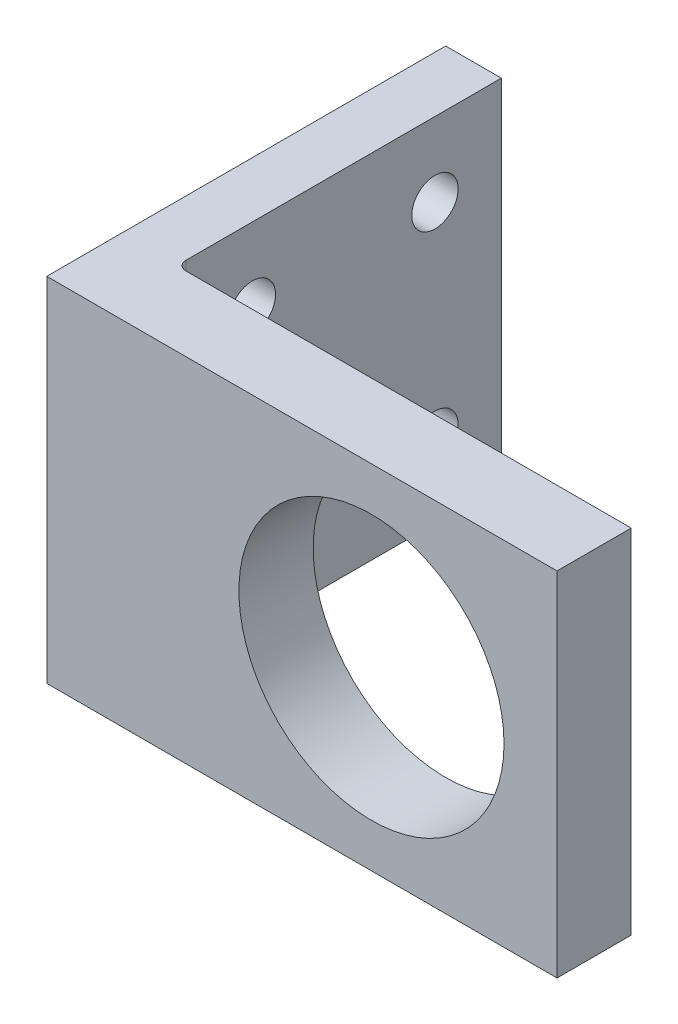
ISO-10303-21;
HEADER;
FILE_DESCRIPTION(('STEP AP214'),'2;1');
FILE_NAME('part.step','',(''),(''),'','','');
FILE_SCHEMA(('AUTOMOTIVE_DESIGN { 1 0 10303 214 1 1 1 1 }'));
ENDSEC;
DATA;
#1=APPLICATION_CONTEXT('core data for automotive mechanical design processes');
#2=APPLICATION_PROTOCOL_DEFINITION('international standard','automotive_design',2000,#1);
#3=PRODUCT_CONTEXT('',#1,'mechanical');
#4=PRODUCT('Part','Part','',(#3));
#5=PRODUCT_RELATED_PRODUCT_CATEGORY('part','',(#4));
#6=PRODUCT_DEFINITION_FORMATION('','',#4);
#7=PRODUCT_DEFINITION_CONTEXT('part definition',#1,'design');
#8=PRODUCT_DEFINITION('design','',#6,#7);
#9=PRODUCT_DEFINITION_SHAPE('','',#8);
#10=(LENGTH_UNIT() NAMED_UNIT(*) SI_UNIT(.MILLI.,.METRE.));
#11=(NAMED_UNIT(*) PLANE_ANGLE_UNIT() SI_UNIT($,.RADIAN.));
#12=(NAMED_UNIT(*) SI_UNIT($,.STERADIAN.) SOLID_ANGLE_UNIT());
#13=UNCERTAINTY_MEASURE_WITH_UNIT(LENGTH_MEASURE(1.E-05),#10,'distance_accuracy_value','');
#14=(GEOMETRIC_REPRESENTATION_CONTEXT(3) GLOBAL_UNCERTAINTY_ASSIGNED_CONTEXT((#13)) GLOBAL_UNIT_ASSIGNED_CONTEXT((#10,
#11,#12)) REPRESENTATION_CONTEXT('',''));
#15=CARTESIAN_POINT('',(0.,0.,0.));
#16=DIRECTION('',(0.,0.,1.));
#17=DIRECTION('',(1.,0.,0.));
#18=AXIS2_PLACEMENT_3D('',#15,#16,#17);
#19=CARTESIAN_POINT('',(7.,0.,-1.));
#20=DIRECTION('',(0.,1.,0.));
#21=DIRECTION('',(-1.,0.,0.));
#22=AXIS2_PLACEMENT_3D('',#19,#20,#21);
#23=CYLINDRICAL_SURFACE('',#22,1.);
#24=DIRECTION('',(0.,1.,0.));
#25=VECTOR('',#24,1.);
#26=CARTESIAN_POINT('',(7.,0.,0.));
#27=LINE('',#26,#25);
#28=CARTESIAN_POINT('',(7.,0.,0.));
#29=VERTEX_POINT('',#28);
#30=CARTESIAN_POINT('',(7.,38.,0.));
#31=VERTEX_POINT('',#30);
#32=EDGE_CURVE('E146',#29,#31,#27,.T.);
#33=ORIENTED_EDGE('',*,*,#32,.F.);
#34=CARTESIAN_POINT('',(7.,0.,-1.));
#35=DIRECTION('',(0.,1.,0.));
#36=DIRECTION('',(-1.,0.,0.));
#37=AXIS2_PLACEMENT_3D('',#34,#35,#36);
#38=CIRCLE('',#37,1.);
#39=CARTESIAN_POINT('',(6.,0.,-1.));
#40=VERTEX_POINT('',#39);
#41=EDGE_CURVE('E41',#29,#40,#38,.F.);
#42=ORIENTED_EDGE('',*,*,#41,.T.);
#43=DIRECTION('',(0.,1.,0.));
#44=VECTOR('',#43,1.);
#45=CARTESIAN_POINT('',(6.,0.,-1.));
#46=LINE('',#45,#44);
#47=CARTESIAN_POINT('',(6.,38.,-1.));
#48=VERTEX_POINT('',#47);
#49=EDGE_CURVE('E149',#48,#40,#46,.F.);
#50=ORIENTED_EDGE('',*,*,#49,.F.);
#51=CARTESIAN_POINT('',(7.,38.,-1.));
#52=DIRECTION('',(0.,-1.,0.));
#53=DIRECTION('',(1.,0.,0.));
#54=AXIS2_PLACEMENT_3D('',#51,#52,#53);
#55=CIRCLE('',#54,1.);
#56=EDGE_CURVE('E11',#48,#31,#55,.F.);
#57=ORIENTED_EDGE('',*,*,#56,.T.);
#58=EDGE_LOOP('',(#33,#42,#50,#57));
#59=FACE_BOUND('',#58,.T.);
#60=ADVANCED_FACE('F34',(#59),#23,.F.);
#61=CARTESIAN_POINT('',(0.,0.,8.));
#62=DIRECTION('',(0.,0.,-1.));
#63=DIRECTION('',(-1.,0.,0.));
#64=AXIS2_PLACEMENT_3D('',#61,#62,#63);
#65=PLANE('',#64);
#66=DIRECTION('',(0.,-1.,0.));
#67=VECTOR('',#66,1.);
#68=CARTESIAN_POINT('',(0.,0.,8.));
#69=LINE('',#68,#67);
#70=CARTESIAN_POINT('',(0.,38.,8.));
#71=VERTEX_POINT('',#70);
#72=CARTESIAN_POINT('',(0.,0.,8.));
#73=VERTEX_POINT('',#72);
#74=EDGE_CURVE('E122',#71,#73,#69,.T.);
#75=ORIENTED_EDGE('',*,*,#74,.T.);
#76=DIRECTION('',(1.,0.,0.));
#77=VECTOR('',#76,1.);
#78=CARTESIAN_POINT('',(0.,0.,8.));
#79=LINE('',#78,#77);
#80=CARTESIAN_POINT('',(55.,0.,8.));
#81=VERTEX_POINT('',#80);
#82=EDGE_CURVE('E125',#73,#81,#79,.T.);
#83=ORIENTED_EDGE('',*,*,#82,.T.);
#84=DIRECTION('',(0.,1.,0.));
#85=VECTOR('',#84,1.);
#86=CARTESIAN_POINT('',(55.,0.,8.));
#87=LINE('',#86,#85);
#88=CARTESIAN_POINT('',(55.,38.,8.));
#89=VERTEX_POINT('',#88);
#90=EDGE_CURVE('E128',#81,#89,#87,.T.);
#91=ORIENTED_EDGE('',*,*,#90,.T.);
#92=DIRECTION('',(-1.,0.,0.));
#93=VECTOR('',#92,1.);
#94=CARTESIAN_POINT('',(0.,38.,8.));
#95=LINE('',#94,#93);
#96=EDGE_CURVE('E130',#89,#71,#95,.T.);
#97=ORIENTED_EDGE('',*,*,#96,.T.);
#98=EDGE_LOOP('',(#75,#83,#91,#97));
#99=FACE_BOUND('',#98,.T.);
#100=CARTESIAN_POINT('',(35.,19.,8.));
#101=DIRECTION('',(0.,0.,1.));
#102=DIRECTION('',(1.,0.,0.));
#103=AXIS2_PLACEMENT_3D('',#100,#101,#102);
#104=CIRCLE('',#103,14.2875);
#105=CARTESIAN_POINT('',(49.2875,19.,8.));
#106=VERTEX_POINT('',#105);
#107=EDGE_CURVE('E114',#106,#106,#104,.T.);
#108=ORIENTED_EDGE('',*,*,#107,.F.);
#109=EDGE_LOOP('',(#108));
#110=FACE_BOUND('',#109,.T.);
#111=ADVANCED_FACE('F205',(#99,#110),#65,.F.);
#112=CARTESIAN_POINT('',(0.,0.,0.));
#113=DIRECTION('',(0.,0.,-1.));
#114=DIRECTION('',(-1.,0.,0.));
#115=AXIS2_PLACEMENT_3D('',#112,#113,#114);
#116=PLANE('',#115);
#117=DIRECTION('',(1.,0.,0.));
#118=VECTOR('',#117,1.);
#119=CARTESIAN_POINT('',(0.,0.,0.));
#120=LINE('',#119,#118);
#121=CARTESIAN_POINT('',(55.,0.,0.));
#122=VERTEX_POINT('',#121);
#123=EDGE_CURVE('E120',#29,#122,#120,.T.);
#124=ORIENTED_EDGE('',*,*,#123,.F.);
#125=ORIENTED_EDGE('',*,*,#32,.T.);
#126=DIRECTION('',(-1.,0.,0.));
#127=VECTOR('',#126,1.);
#128=CARTESIAN_POINT('',(0.,38.,0.));
#129=LINE('',#128,#127);
#130=CARTESIAN_POINT('',(55.,38.,0.));
#131=VERTEX_POINT('',#130);
#132=EDGE_CURVE('E126',#131,#31,#129,.T.);
#133=ORIENTED_EDGE('',*,*,#132,.F.);
#134=DIRECTION('',(0.,1.,0.));
#135=VECTOR('',#134,1.);
#136=CARTESIAN_POINT('',(55.,0.,0.));
#137=LINE('',#136,#135);
#138=EDGE_CURVE('E134',#122,#131,#137,.T.);
#139=ORIENTED_EDGE('',*,*,#138,.F.);
#140=EDGE_LOOP('',(#124,#125,#133,#139));
#141=FACE_BOUND('',#140,.T.);
#142=CARTESIAN_POINT('',(35.,19.,0.));
#143=DIRECTION('',(0.,0.,1.));
#144=DIRECTION('',(1.,0.,0.));
#145=AXIS2_PLACEMENT_3D('',#142,#143,#144);
#146=CIRCLE('',#145,14.2875);
#147=CARTESIAN_POINT('',(49.2875,19.,0.));
#148=VERTEX_POINT('',#147);
#149=EDGE_CURVE('E111',#148,#148,#146,.T.);
#150=ORIENTED_EDGE('',*,*,#149,.T.);
#151=EDGE_LOOP('',(#150));
#152=FACE_BOUND('',#151,.T.);
#153=ADVANCED_FACE('F198',(#141,#152),#116,.T.);
#154=CARTESIAN_POINT('',(0.,0.,8.));
#155=DIRECTION('',(1.,0.,0.));
#156=DIRECTION('',(0.,0.,-1.));
#157=AXIS2_PLACEMENT_3D('',#154,#155,#156);
#158=PLANE('',#157);
#159=CARTESIAN_POINT('',(0.,30.,-27.8421052631579));
#160=DIRECTION('',(1.,0.,0.));
#161=DIRECTION('',(0.,0.,-1.));
#162=AXIS2_PLACEMENT_3D('',#159,#160,#161);
#163=CIRCLE('',#162,2.5);
#164=CARTESIAN_POINT('',(0.,30.,-30.3421052631579));
#165=VERTEX_POINT('',#164);
#166=EDGE_CURVE('E108',#165,#165,#163,.T.);
#167=ORIENTED_EDGE('',*,*,#166,.T.);
#168=EDGE_LOOP('',(#167));
#169=FACE_BOUND('',#168,.T.);
#170=CARTESIAN_POINT('',(0.,8.,-27.8421052631579));
#171=DIRECTION('',(1.,0.,0.));
#172=DIRECTION('',(0.,0.,-1.));
#173=AXIS2_PLACEMENT_3D('',#170,#171,#172);
#174=CIRCLE('',#173,2.5);
#175=CARTESIAN_POINT('',(0.,8.,-30.3421052631579));
#176=VERTEX_POINT('',#175);
#177=EDGE_CURVE('E157',#176,#176,#174,.T.);
#178=ORIENTED_EDGE('',*,*,#177,.T.);
#179=EDGE_LOOP('',(#178));
#180=FACE_BOUND('',#179,.T.);
#181=CARTESIAN_POINT('',(0.,8.,-8.15789473684211));
#182=DIRECTION('',(1.,0.,0.));
#183=DIRECTION('',(0.,0.,-1.));
#184=AXIS2_PLACEMENT_3D('',#181,#182,#183);
#185=CIRCLE('',#184,2.5);
#186=CARTESIAN_POINT('',(0.,8.,-10.6578947368421));
#187=VERTEX_POINT('',#186);
#188=EDGE_CURVE('E160',#187,#187,#185,.T.);
#189=ORIENTED_EDGE('',*,*,#188,.T.);
#190=EDGE_LOOP('',(#189));
#191=FACE_BOUND('',#190,.T.);
#192=CARTESIAN_POINT('',(0.,30.,-8.15789473684211));
#193=DIRECTION('',(1.,0.,0.));
#194=DIRECTION('',(0.,0.,-1.));
#195=AXIS2_PLACEMENT_3D('',#192,#193,#194);
#196=CIRCLE('',#195,2.5);
#197=CARTESIAN_POINT('',(0.,30.,-10.6578947368421));
#198=VERTEX_POINT('',#197);
#199=EDGE_CURVE('E163',#198,#198,#196,.T.);
#200=ORIENTED_EDGE('',*,*,#199,.T.);
#201=EDGE_LOOP('',(#200));
#202=FACE_BOUND('',#201,.T.);
#203=DIRECTION('',(0.,0.,-1.));
#204=VECTOR('',#203,1.);
#205=CARTESIAN_POINT('',(0.,38.,8.));
#206=LINE('',#205,#204);
#207=CARTESIAN_POINT('',(0.,38.,-35.));
#208=VERTEX_POINT('',#207);
#209=EDGE_CURVE('E132',#71,#208,#206,.T.);
#210=ORIENTED_EDGE('',*,*,#209,.T.);
#211=DIRECTION('',(0.,1.,0.));
#212=VECTOR('',#211,1.);
#213=CARTESIAN_POINT('',(0.,0.,-35.));
#214=LINE('',#213,#212);
#215=CARTESIAN_POINT('',(0.,0.,-35.));
#216=VERTEX_POINT('',#215);
#217=EDGE_CURVE('E106',#216,#208,#214,.T.);
#218=ORIENTED_EDGE('',*,*,#217,.F.);
#219=DIRECTION('',(0.,0.,-1.));
#220=VECTOR('',#219,1.);
#221=CARTESIAN_POINT('',(0.,0.,8.));
#222=LINE('',#221,#220);
#223=EDGE_CURVE('E144',#73,#216,#222,.T.);
#224=ORIENTED_EDGE('',*,*,#223,.F.);
#225=ORIENTED_EDGE('',*,*,#74,.F.);
#226=EDGE_LOOP('',(#210,#218,#224,#225));
#227=FACE_BOUND('',#226,.T.);
#228=ADVANCED_FACE('F195',(#169,#180,#191,#202,#227),#158,.F.);
#229=CARTESIAN_POINT('',(0.,0.,8.));
#230=DIRECTION('',(0.,1.,0.));
#231=DIRECTION('',(-1.,0.,0.));
#232=AXIS2_PLACEMENT_3D('',#229,#230,#231);
#233=PLANE('',#232);
#234=ORIENTED_EDGE('',*,*,#41,.F.);
#235=ORIENTED_EDGE('',*,*,#123,.T.);
#236=DIRECTION('',(0.,0.,-1.));
#237=VECTOR('',#236,1.);
#238=CARTESIAN_POINT('',(55.,0.,8.));
#239=LINE('',#238,#237);
#240=EDGE_CURVE('E141',#81,#122,#239,.T.);
#241=ORIENTED_EDGE('',*,*,#240,.F.);
#242=ORIENTED_EDGE('',*,*,#82,.F.);
#243=ORIENTED_EDGE('',*,*,#223,.T.);
#244=DIRECTION('',(-1.,0.,0.));
#245=VECTOR('',#244,1.);
#246=CARTESIAN_POINT('',(0.,0.,-35.));
#247=LINE('',#246,#245);
#248=CARTESIAN_POINT('',(6.,0.,-35.));
#249=VERTEX_POINT('',#248);
#250=EDGE_CURVE('E99',#249,#216,#247,.T.);
#251=ORIENTED_EDGE('',*,*,#250,.F.);
#252=DIRECTION('',(0.,0.,1.));
#253=VECTOR('',#252,1.);
#254=CARTESIAN_POINT('',(6.,0.,-35.));
#255=LINE('',#254,#253);
#256=EDGE_CURVE('E95',#249,#40,#255,.T.);
#257=ORIENTED_EDGE('',*,*,#256,.T.);
#258=EDGE_LOOP('',(#234,#235,#241,#242,#243,#251,#257));
#259=FACE_BOUND('',#258,.T.);
#260=ADVANCED_FACE('F151',(#259),#233,.F.);
#261=CARTESIAN_POINT('',(55.,0.,8.));
#262=DIRECTION('',(-1.,0.,0.));
#263=DIRECTION('',(0.,0.,1.));
#264=AXIS2_PLACEMENT_3D('',#261,#262,#263);
#265=PLANE('',#264);
#266=ORIENTED_EDGE('',*,*,#138,.T.);
#267=DIRECTION('',(0.,0.,-1.));
#268=VECTOR('',#267,1.);
#269=CARTESIAN_POINT('',(55.,38.,8.));
#270=LINE('',#269,#268);
#271=EDGE_CURVE('E138',#89,#131,#270,.T.);
#272=ORIENTED_EDGE('',*,*,#271,.F.);
#273=ORIENTED_EDGE('',*,*,#90,.F.);
#274=ORIENTED_EDGE('',*,*,#240,.T.);
#275=EDGE_LOOP('',(#266,#272,#273,#274));
#276=FACE_BOUND('',#275,.T.);
#277=ADVANCED_FACE('F210',(#276),#265,.F.);
#278=CARTESIAN_POINT('',(0.,38.,8.));
#279=DIRECTION('',(0.,-1.,0.));
#280=DIRECTION('',(1.,0.,0.));
#281=AXIS2_PLACEMENT_3D('',#278,#279,#280);
#282=PLANE('',#281);
#283=ORIENTED_EDGE('',*,*,#132,.T.);
#284=ORIENTED_EDGE('',*,*,#56,.F.);
#285=DIRECTION('',(0.,0.,1.));
#286=VECTOR('',#285,1.);
#287=CARTESIAN_POINT('',(6.,38.,-35.));
#288=LINE('',#287,#286);
#289=CARTESIAN_POINT('',(6.,38.,-35.));
#290=VERTEX_POINT('',#289);
#291=EDGE_CURVE('E93',#290,#48,#288,.T.);
#292=ORIENTED_EDGE('',*,*,#291,.F.);
#293=DIRECTION('',(1.,0.,0.));
#294=VECTOR('',#293,1.);
#295=CARTESIAN_POINT('',(0.,38.,-35.));
#296=LINE('',#295,#294);
#297=EDGE_CURVE('E100',#208,#290,#296,.T.);
#298=ORIENTED_EDGE('',*,*,#297,.F.);
#299=ORIENTED_EDGE('',*,*,#209,.F.);
#300=ORIENTED_EDGE('',*,*,#96,.F.);
#301=ORIENTED_EDGE('',*,*,#271,.T.);
#302=EDGE_LOOP('',(#283,#284,#292,#298,#299,#300,#301));
#303=FACE_BOUND('',#302,.T.);
#304=ADVANCED_FACE('F110',(#303),#282,.F.);
#305=CARTESIAN_POINT('',(35.,19.,8.));
#306=DIRECTION('',(0.,0.,-1.));
#307=DIRECTION('',(-1.,0.,0.));
#308=AXIS2_PLACEMENT_3D('',#305,#306,#307);
#309=CYLINDRICAL_SURFACE('',#308,14.2875);
#310=ORIENTED_EDGE('',*,*,#107,.T.);
#311=EDGE_LOOP('',(#310));
#312=FACE_BOUND('',#311,.T.);
#313=ORIENTED_EDGE('',*,*,#149,.F.);
#314=EDGE_LOOP('',(#313));
#315=FACE_BOUND('',#314,.T.);
#316=ADVANCED_FACE('F184',(#312,#315),#309,.F.);
#317=CARTESIAN_POINT('',(6.,0.,-35.));
#318=DIRECTION('',(-1.,0.,0.));
#319=DIRECTION('',(0.,-1.,0.));
#320=AXIS2_PLACEMENT_3D('',#317,#318,#319);
#321=PLANE('',#320);
#322=CARTESIAN_POINT('',(6.,30.,-27.8421052631579));
#323=DIRECTION('',(1.,0.,0.));
#324=DIRECTION('',(0.,-1.,0.));
#325=AXIS2_PLACEMENT_3D('',#322,#323,#324);
#326=CIRCLE('',#325,2.5);
#327=CARTESIAN_POINT('',(6.,27.5,-27.8421052631579));
#328=VERTEX_POINT('',#327);
#329=EDGE_CURVE('E170',#328,#328,#326,.T.);
#330=ORIENTED_EDGE('',*,*,#329,.F.);
#331=EDGE_LOOP('',(#330));
#332=FACE_BOUND('',#331,.T.);
#333=CARTESIAN_POINT('',(6.,8.,-27.8421052631579));
#334=DIRECTION('',(1.,0.,0.));
#335=DIRECTION('',(0.,1.,0.));
#336=AXIS2_PLACEMENT_3D('',#333,#334,#335);
#337=CIRCLE('',#336,2.5);
#338=CARTESIAN_POINT('',(6.,10.5,-27.8421052631579));
#339=VERTEX_POINT('',#338);
#340=EDGE_CURVE('E173',#339,#339,#337,.T.);
#341=ORIENTED_EDGE('',*,*,#340,.F.);
#342=EDGE_LOOP('',(#341));
#343=FACE_BOUND('',#342,.T.);
#344=CARTESIAN_POINT('',(6.,8.,-8.15789473684211));
#345=DIRECTION('',(1.,0.,0.));
#346=DIRECTION('',(0.,-1.,0.));
#347=AXIS2_PLACEMENT_3D('',#344,#345,#346);
#348=CIRCLE('',#347,2.5);
#349=CARTESIAN_POINT('',(6.,5.5,-8.15789473684211));
#350=VERTEX_POINT('',#349);
#351=EDGE_CURVE('E169',#350,#350,#348,.T.);
#352=ORIENTED_EDGE('',*,*,#351,.F.);
#353=EDGE_LOOP('',(#352));
#354=FACE_BOUND('',#353,.T.);
#355=CARTESIAN_POINT('',(6.,30.,-8.15789473684211));
#356=DIRECTION('',(1.,0.,0.));
#357=DIRECTION('',(0.,1.,0.));
#358=AXIS2_PLACEMENT_3D('',#355,#356,#357);
#359=CIRCLE('',#358,2.5);
#360=CARTESIAN_POINT('',(6.,32.5,-8.15789473684211));
#361=VERTEX_POINT('',#360);
#362=EDGE_CURVE('E166',#361,#361,#359,.T.);
#363=ORIENTED_EDGE('',*,*,#362,.F.);
#364=EDGE_LOOP('',(#363));
#365=FACE_BOUND('',#364,.T.);
#366=ORIENTED_EDGE('',*,*,#291,.T.);
#367=ORIENTED_EDGE('',*,*,#49,.T.);
#368=ORIENTED_EDGE('',*,*,#256,.F.);
#369=DIRECTION('',(0.,-1.,0.));
#370=VECTOR('',#369,1.);
#371=CARTESIAN_POINT('',(6.,0.,-35.));
#372=LINE('',#371,#370);
#373=EDGE_CURVE('E90',#290,#249,#372,.T.);
#374=ORIENTED_EDGE('',*,*,#373,.F.);
#375=EDGE_LOOP('',(#366,#367,#368,#374));
#376=FACE_BOUND('',#375,.T.);
#377=ADVANCED_FACE('F92',(#332,#343,#354,#365,#376),#321,.F.);
#378=CARTESIAN_POINT('',(0.,0.,-35.));
#379=DIRECTION('',(0.,0.,-1.));
#380=DIRECTION('',(-1.,0.,0.));
#381=AXIS2_PLACEMENT_3D('',#378,#379,#380);
#382=PLANE('',#381);
#383=ORIENTED_EDGE('',*,*,#297,.T.);
#384=ORIENTED_EDGE('',*,*,#373,.T.);
#385=ORIENTED_EDGE('',*,*,#250,.T.);
#386=ORIENTED_EDGE('',*,*,#217,.T.);
#387=EDGE_LOOP('',(#383,#384,#385,#386));
#388=FACE_BOUND('',#387,.T.);
#389=ADVANCED_FACE('F104',(#388),#382,.T.);
#390=CARTESIAN_POINT('',(-4.,30.,-8.15789473684211));
#391=DIRECTION('',(1.,0.,0.));
#392=DIRECTION('',(0.,1.,0.));
#393=AXIS2_PLACEMENT_3D('',#390,#391,#392);
#394=CYLINDRICAL_SURFACE('',#393,2.5);
#395=ORIENTED_EDGE('',*,*,#362,.T.);
#396=EDGE_LOOP('',(#395));
#397=FACE_BOUND('',#396,.T.);
#398=ORIENTED_EDGE('',*,*,#199,.F.);
#399=EDGE_LOOP('',(#398));
#400=FACE_BOUND('',#399,.T.);
#401=ADVANCED_FACE('F189',(#397,#400),#394,.F.);
#402=CARTESIAN_POINT('',(-4.,8.,-8.15789473684211));
#403=DIRECTION('',(1.,0.,0.));
#404=DIRECTION('',(0.,1.,0.));
#405=AXIS2_PLACEMENT_3D('',#402,#403,#404);
#406=CYLINDRICAL_SURFACE('',#405,2.5);
#407=ORIENTED_EDGE('',*,*,#351,.T.);
#408=EDGE_LOOP('',(#407));
#409=FACE_BOUND('',#408,.T.);
#410=ORIENTED_EDGE('',*,*,#188,.F.);
#411=EDGE_LOOP('',(#410));
#412=FACE_BOUND('',#411,.T.);
#413=ADVANCED_FACE('F179',(#409,#412),#406,.F.);
#414=CARTESIAN_POINT('',(-4.,8.,-27.8421052631579));
#415=DIRECTION('',(1.,0.,0.));
#416=DIRECTION('',(0.,1.,0.));
#417=AXIS2_PLACEMENT_3D('',#414,#415,#416);
#418=CYLINDRICAL_SURFACE('',#417,2.5);
#419=ORIENTED_EDGE('',*,*,#340,.T.);
#420=EDGE_LOOP('',(#419));
#421=FACE_BOUND('',#420,.T.);
#422=ORIENTED_EDGE('',*,*,#177,.F.);
#423=EDGE_LOOP('',(#422));
#424=FACE_BOUND('',#423,.T.);
#425=ADVANCED_FACE('F270',(#421,#424),#418,.F.);
#426=CARTESIAN_POINT('',(-4.,30.,-27.8421052631579));
#427=DIRECTION('',(1.,0.,0.));
#428=DIRECTION('',(0.,1.,0.));
#429=AXIS2_PLACEMENT_3D('',#426,#427,#428);
#430=CYLINDRICAL_SURFACE('',#429,2.5);
#431=ORIENTED_EDGE('',*,*,#329,.T.);
#432=EDGE_LOOP('',(#431));
#433=FACE_BOUND('',#432,.T.);
#434=ORIENTED_EDGE('',*,*,#166,.F.);
#435=EDGE_LOOP('',(#434));
#436=FACE_BOUND('',#435,.T.);
#437=ADVANCED_FACE('F277',(#433,#436),#430,.F.);
#438=CLOSED_SHELL('',(#60,#111,#153,#228,#260,#277,#304,#316,#377,#389,#401,#413,#425,#437));
#439=MANIFOLD_SOLID_BREP('B2',#438);
#440=ADVANCED_BREP_SHAPE_REPRESENTATION('',(#18,#439),#14);
#441=SHAPE_DEFINITION_REPRESENTATION(#9,#440);
ENDSEC;
END-ISO-10303-21;
